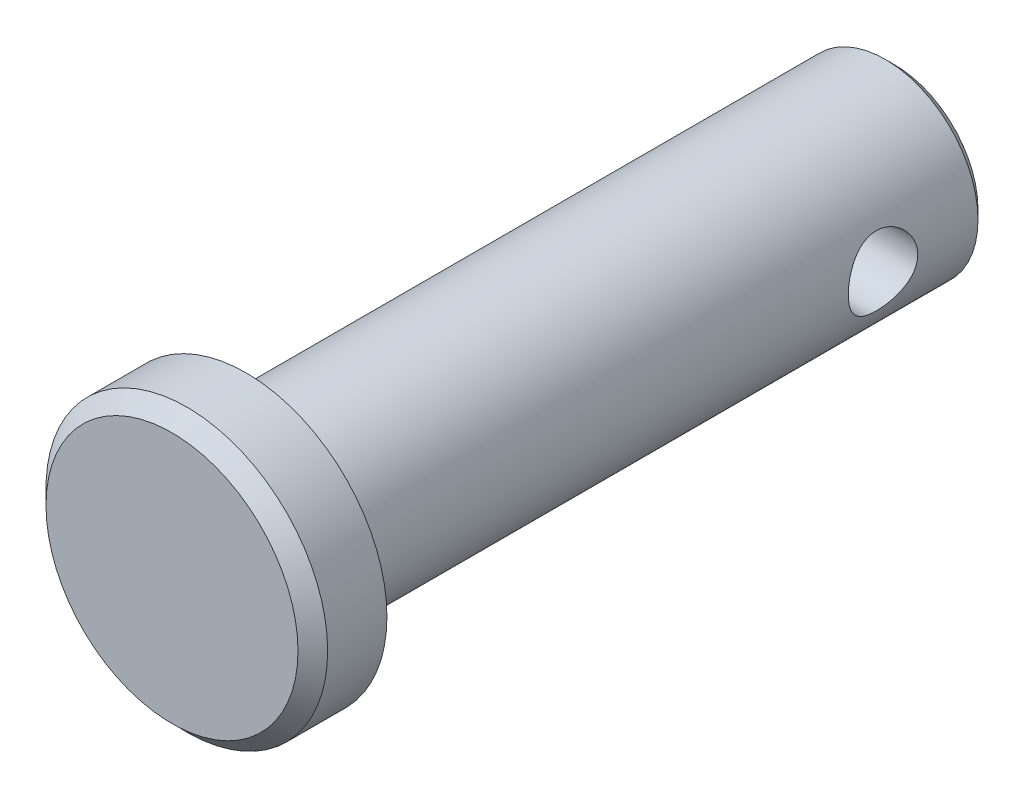
ISO-10303-21;
HEADER;
FILE_DESCRIPTION(('STEP AP214'),'2;1');
FILE_NAME('part.step','',(''),(''),'','','');
FILE_SCHEMA(('AUTOMOTIVE_DESIGN { 1 0 10303 214 1 1 1 1 }'));
ENDSEC;
DATA;
#1=APPLICATION_CONTEXT('core data for automotive mechanical design processes');
#2=APPLICATION_PROTOCOL_DEFINITION('international standard','automotive_design',2000,#1);
#3=PRODUCT_CONTEXT('',#1,'mechanical');
#4=PRODUCT('Part','Part','',(#3));
#5=PRODUCT_RELATED_PRODUCT_CATEGORY('part','',(#4));
#6=PRODUCT_DEFINITION_FORMATION('','',#4);
#7=PRODUCT_DEFINITION_CONTEXT('part definition',#1,'design');
#8=PRODUCT_DEFINITION('design','',#6,#7);
#9=PRODUCT_DEFINITION_SHAPE('','',#8);
#10=(LENGTH_UNIT() NAMED_UNIT(*) SI_UNIT(.MILLI.,.METRE.));
#11=(NAMED_UNIT(*) PLANE_ANGLE_UNIT() SI_UNIT($,.RADIAN.));
#12=(NAMED_UNIT(*) SI_UNIT($,.STERADIAN.) SOLID_ANGLE_UNIT());
#13=UNCERTAINTY_MEASURE_WITH_UNIT(LENGTH_MEASURE(1.E-05),#10,'distance_accuracy_value','');
#14=(GEOMETRIC_REPRESENTATION_CONTEXT(3) GLOBAL_UNCERTAINTY_ASSIGNED_CONTEXT((#13)) GLOBAL_UNIT_ASSIGNED_CONTEXT((#10,
#11,#12)) REPRESENTATION_CONTEXT('',''));
#15=CARTESIAN_POINT('',(0.,0.,0.));
#16=DIRECTION('',(0.,0.,1.));
#17=DIRECTION('',(1.,0.,0.));
#18=AXIS2_PLACEMENT_3D('',#15,#16,#17);
#19=CARTESIAN_POINT('',(-15.8559603431999,0.30035181385607,26.6681573409942));
#20=DIRECTION('',(0.,0.,-1.));
#21=DIRECTION('',(-1.,0.,0.));
#22=AXIS2_PLACEMENT_3D('',#19,#20,#21);
#23=CYLINDRICAL_SURFACE('',#22,3.175);
#24=CARTESIAN_POINT('',(-15.8559603431999,0.300351813856042,4.76065734099418));
#25=DIRECTION('',(0.,0.,1.));
#26=DIRECTION('',(1.,0.,0.));
#27=AXIS2_PLACEMENT_3D('',#24,#25,#26);
#28=CIRCLE('',#27,3.175);
#29=CARTESIAN_POINT('',(-12.6809603431999,0.300351813856042,4.76065734099418));
#30=VERTEX_POINT('',#29);
#31=EDGE_CURVE('E43',#30,#30,#28,.T.);
#32=ORIENTED_EDGE('',*,*,#31,.T.);
#33=EDGE_LOOP('',(#32));
#34=FACE_BOUND('',#33,.T.);
#35=CARTESIAN_POINT('',(-19.0309603431998,0.300351813855987,9.20565734099418));
#36=CARTESIAN_POINT('',(-19.030962069258,0.235871485824077,9.20565964469727));
#37=CARTESIAN_POINT('',(-19.0289789787602,0.17140693444171,9.20040290629703));
#38=CARTESIAN_POINT('',(-19.0212662427549,0.0444043860513533,9.17959996099868));
#39=CARTESIAN_POINT('',(-19.0155371369209,-0.0181338871091078,9.16405523624567));
#40=CARTESIAN_POINT('',(-19.0009473253077,-0.139433934230442,9.12330339583785));
#41=CARTESIAN_POINT('',(-18.9920926627236,-0.198202739072755,9.09811491826689));
#42=CARTESIAN_POINT('',(-18.9721336873374,-0.310676388583671,9.03888537566288));
#43=CARTESIAN_POINT('',(-18.9610287713186,-0.364379869741417,9.00484193621852));
#44=CARTESIAN_POINT('',(-18.9371886785339,-0.467479404674099,8.92735864445665));
#45=CARTESIAN_POINT('',(-18.924407363707,-0.516631828201475,8.88360894532577));
#46=CARTESIAN_POINT('',(-18.8988820963661,-0.607098281596737,8.78861280848372));
#47=CARTESIAN_POINT('',(-18.8861381564592,-0.648409912245172,8.73736408459944));
#48=CARTESIAN_POINT('',(-18.8615937037281,-0.723571416233376,8.62644410114764));
#49=CARTESIAN_POINT('',(-18.8498476182151,-0.757077119635308,8.56652637504843));
#50=CARTESIAN_POINT('',(-18.8293467338345,-0.813427441420762,8.4413964598729));
#51=CARTESIAN_POINT('',(-18.820590740571,-0.836276318023833,8.37618639773981));
#52=CARTESIAN_POINT('',(-18.8075547449915,-0.869702607345791,8.24512717841424));
#53=CARTESIAN_POINT('',(-18.8031058677347,-0.880744957316267,8.17941396673605));
#54=CARTESIAN_POINT('',(-18.7986937060482,-0.891698416113912,8.04692826558657));
#55=CARTESIAN_POINT('',(-18.7987285691205,-0.891614122014858,7.98015622498132));
#56=CARTESIAN_POINT('',(-18.8031343417792,-0.880672221173496,7.85170278035641));
#57=CARTESIAN_POINT('',(-18.8072456273644,-0.870459666184172,7.78995587182164));
#58=CARTESIAN_POINT('',(-18.8189095390475,-0.840617518598842,7.66912629035998));
#59=CARTESIAN_POINT('',(-18.8264626833846,-0.820986507846121,7.61004402011941));
#60=CARTESIAN_POINT('',(-18.844315604335,-0.772510440433503,7.4949061684849));
#61=CARTESIAN_POINT('',(-18.854664642231,-0.743498085494725,7.43892899888542));
#62=CARTESIAN_POINT('',(-18.8769268861807,-0.677199521635373,7.33245041178137));
#63=CARTESIAN_POINT('',(-18.8888406317034,-0.639910456054575,7.28195089383792));
#64=CARTESIAN_POINT('',(-18.913866651644,-0.555166070978449,7.18429068297129));
#65=CARTESIAN_POINT('',(-18.9270056636293,-0.507195932209815,7.13758248240039));
#66=CARTESIAN_POINT('',(-18.9523134355023,-0.403952555106571,7.05273908031835));
#67=CARTESIAN_POINT('',(-18.9644820460858,-0.348678196419987,7.01460519640093));
#68=CARTESIAN_POINT('',(-18.9867198519969,-0.231241164256682,6.9474938383258));
#69=CARTESIAN_POINT('',(-18.9967536731356,-0.16898519025821,6.91866707339997));
#70=CARTESIAN_POINT('',(-19.0133289199202,-0.0400374362478723,6.87204614885484));
#71=CARTESIAN_POINT('',(-19.0198718965355,0.0266523589971825,6.85424708909879));
#72=CARTESIAN_POINT('',(-19.0284556113227,0.158766464606748,6.83105675338276));
#73=CARTESIAN_POINT('',(-19.0307172098413,0.224069565828493,6.82505614717806));
#74=CARTESIAN_POINT('',(-19.0311658744446,0.354781216089662,6.82385880902362));
#75=CARTESIAN_POINT('',(-19.0293538438956,0.420189738536532,6.82865968174275));
#76=CARTESIAN_POINT('',(-19.0220045395202,0.546622314901957,6.84846593707668));
#77=CARTESIAN_POINT('',(-19.0166130814632,0.607718267961813,6.86307212883547));
#78=CARTESIAN_POINT('',(-19.0027939426154,0.726549331853281,6.9015487860786));
#79=CARTESIAN_POINT('',(-18.9943658669385,0.78428400444433,6.92542045649044));
#80=CARTESIAN_POINT('',(-18.9749979869359,0.896654727412172,6.98251155586802));
#81=CARTESIAN_POINT('',(-18.9639916573616,0.951149886430009,7.01598503856522));
#82=CARTESIAN_POINT('',(-18.9406845487444,1.05393227878902,7.09104233538658));
#83=CARTESIAN_POINT('',(-18.9283832925879,1.10221720932066,7.13262914370189));
#84=CARTESIAN_POINT('',(-18.9029548960346,1.19413876035948,7.22557186293033));
#85=CARTESIAN_POINT('',(-18.8898212466983,1.23734316221186,7.27735457356999));
#86=CARTESIAN_POINT('',(-18.8648984431906,1.31453452348426,7.38769312760586));
#87=CARTESIAN_POINT('',(-18.8531094098055,1.34852065520873,7.4462495785338));
#88=CARTESIAN_POINT('',(-18.8322595549157,1.40634539116304,7.56895753049471));
#89=CARTESIAN_POINT('',(-18.8232102533073,1.43014131709095,7.63313123306059));
#90=CARTESIAN_POINT('',(-18.8091392292723,1.46643313887448,7.76500884092138));
#91=CARTESIAN_POINT('',(-18.8041150153437,1.47893602565621,7.83271053472644));
#92=CARTESIAN_POINT('',(-18.798994008116,1.49166219394513,7.96503891762995));
#93=CARTESIAN_POINT('',(-18.7986014966039,1.49262250760426,8.02958386741947));
#94=CARTESIAN_POINT('',(-18.8020302443657,1.48412449426118,8.15786393578839));
#95=CARTESIAN_POINT('',(-18.805851104085,1.47466715516634,8.22159913057725));
#96=CARTESIAN_POINT('',(-18.8170299670343,1.44617610042103,8.34447607720045));
#97=CARTESIAN_POINT('',(-18.8242764583772,1.42744346299345,8.40369865332644));
#98=CARTESIAN_POINT('',(-18.8414251328141,1.38119878204665,8.51819483836165));
#99=CARTESIAN_POINT('',(-18.8513279871619,1.35368451910649,8.57346744464986));
#100=CARTESIAN_POINT('',(-18.8733194016876,1.28898391661508,8.68164485531667));
#101=CARTESIAN_POINT('',(-18.8854953245751,1.25136617422991,8.73427366095411));
#102=CARTESIAN_POINT('',(-18.910359926835,1.16819429433719,8.83270720501509));
#103=CARTESIAN_POINT('',(-18.9230487681861,1.12263763445772,8.87850976598118));
#104=CARTESIAN_POINT('',(-18.9483343385408,1.02193437880384,8.96451764342778));
#105=CARTESIAN_POINT('',(-18.9608889258488,0.966402237700102,9.00428594528297));
#106=CARTESIAN_POINT('',(-18.9837680517026,0.849002309771658,9.07391282361996));
#107=CARTESIAN_POINT('',(-18.9940924166466,0.787134030290414,9.10377062875993));
#108=CARTESIAN_POINT('',(-19.0117062907654,0.655951085195303,9.1535689490513));
#109=CARTESIAN_POINT('',(-19.0188449968944,0.586429967754379,9.17302394852195));
#110=CARTESIAN_POINT('',(-19.0284698905004,0.444715677406051,9.19906362793124));
#111=CARTESIAN_POINT('',(-19.0309584112437,0.372523863095593,9.20565476248725));
#112=CARTESIAN_POINT('',(-19.0309603431998,0.300351813855987,9.20565734099418));
#113=B_SPLINE_CURVE_WITH_KNOTS('',3,(#35,#36,#37,#38,#39,#40,#41,#42,#43,#44,#45,#46,#47,#48,
#49,#50,#51,#52,#53,#54,#55,#56,#57,#58,#59,#60,#61,#62,#63,#64,#65,#66,#67,#68,#69,#70,#71,#72,
#73,#74,#75,#76,#77,#78,#79,#80,#81,#82,#83,#84,#85,#86,#87,#88,#89,#90,#91,#92,#93,#94,#95,#96,
#97,#98,#99,#100,#101,#102,#103,#104,#105,#106,#107,#108,#109,#110,#111,#112),.UNSPECIFIED.,.T.,
.F.,(4,2,2,2,2,2,2,2,2,2,2,2,2,2,2,2,2,2,2,2,2,2,2,2,2,2,2,2,2,2,2,2,2,2,2,2,2,2,4),(0.,
0.193174779988653,0.386321736189723,0.579097274313209,0.771924557564978,0.972134347500262,
1.17240530159709,1.38030485385688,1.58812126298252,1.78741287818411,1.98662215450762,
2.17390936438972,2.36122478335587,2.5520841165719,2.7430094265325,2.94676634210297,
3.15055454712143,3.35749404133318,3.56434151635953,3.76019234336008,3.95599974284967,
4.1442833510204,4.33259145270714,4.5264325735105,4.72034536640764,4.92550862317922,
5.13069029517856,5.33672309214713,5.54262825746723,5.73531018512446,5.92797384230183,
6.11475744301057,6.30158828783598,6.49821274558135,6.6948997896016,6.9022303666289,
7.10957707657801,7.32590383806683,7.54212202675675),.UNSPECIFIED.);
#114=CARTESIAN_POINT('',(-19.0309603431998,0.300351813855987,9.20565734099418));
#115=VERTEX_POINT('',#114);
#116=EDGE_CURVE('E56',#115,#115,#113,.T.);
#117=ORIENTED_EDGE('',*,*,#116,.T.);
#118=EDGE_LOOP('',(#117));
#119=FACE_BOUND('',#118,.T.);
#120=CARTESIAN_POINT('',(-12.6809603431998,0.300351813856015,6.82440734099418));
#121=CARTESIAN_POINT('',(-12.6809586171416,0.235871485824099,6.82440503729109));
#122=CARTESIAN_POINT('',(-12.6829417076396,0.17140693444173,6.82966177569134));
#123=CARTESIAN_POINT('',(-12.6906544436449,0.0444043860513362,6.85046472098969));
#124=CARTESIAN_POINT('',(-12.6963835494787,-0.0181338871091588,6.86600944574269));
#125=CARTESIAN_POINT('',(-12.7109733610919,-0.139433934230485,6.90676128615051));
#126=CARTESIAN_POINT('',(-12.7198280236762,-0.198202739072758,6.93194976372147));
#127=CARTESIAN_POINT('',(-12.7397869990624,-0.310676388583652,6.99117930632548));
#128=CARTESIAN_POINT('',(-12.7508919150811,-0.364379869741418,7.02522274576985));
#129=CARTESIAN_POINT('',(-12.7747320078657,-0.467479404674104,7.10270603753171));
#130=CARTESIAN_POINT('',(-12.7875133226928,-0.516631828201464,7.14645573666258));
#131=CARTESIAN_POINT('',(-12.8130385900338,-0.60709828159672,7.24145187350464));
#132=CARTESIAN_POINT('',(-12.8257825299406,-0.648409912245165,7.29270059738893));
#133=CARTESIAN_POINT('',(-12.8503269826716,-0.723571416233382,7.40362058084072));
#134=CARTESIAN_POINT('',(-12.8620730681847,-0.757077119635316,7.46353830693992));
#135=CARTESIAN_POINT('',(-12.8825739525653,-0.813427441420741,7.58866822211545));
#136=CARTESIAN_POINT('',(-12.8913299458289,-0.836276318023781,7.65387828424855));
#137=CARTESIAN_POINT('',(-12.9043659414084,-0.869702607345732,7.78493750357413));
#138=CARTESIAN_POINT('',(-12.9088148186652,-0.88074495731623,7.85065071525232));
#139=CARTESIAN_POINT('',(-12.9132269803515,-0.891698416113949,7.98313641640179));
#140=CARTESIAN_POINT('',(-12.913192117279,-0.891614122014948,8.04990845700704));
#141=CARTESIAN_POINT('',(-12.9087863446203,-0.880672221173573,8.17836190163196));
#142=CARTESIAN_POINT('',(-12.9046750590354,-0.870459666184191,8.24010881016673));
#143=CARTESIAN_POINT('',(-12.8930111473525,-0.84061751859882,8.36093839162839));
#144=CARTESIAN_POINT('',(-12.8854580030152,-0.820986507846118,8.42002066186895));
#145=CARTESIAN_POINT('',(-12.8676050820648,-0.772510440433505,8.53515851350347));
#146=CARTESIAN_POINT('',(-12.8572560441689,-0.743498085494711,8.59113568310296));
#147=CARTESIAN_POINT('',(-12.8349938002191,-0.677199521635373,8.697614270207));
#148=CARTESIAN_POINT('',(-12.8230800546962,-0.639910456054605,8.74811378815045));
#149=CARTESIAN_POINT('',(-12.7980540347557,-0.555166070978481,8.84577399901707));
#150=CARTESIAN_POINT('',(-12.7849150227705,-0.507195932209816,8.89248219958797));
#151=CARTESIAN_POINT('',(-12.7596072508975,-0.403952555106578,8.97732560167002));
#152=CARTESIAN_POINT('',(-12.7474386403139,-0.348678196420031,9.01545948558744));
#153=CARTESIAN_POINT('',(-12.7252008344029,-0.231241164256732,9.08257084366257));
#154=CARTESIAN_POINT('',(-12.7151670132643,-0.168985190258227,9.1113976085884));
#155=CARTESIAN_POINT('',(-12.6985917664796,-0.0400374362478549,9.15801853313352));
#156=CARTESIAN_POINT('',(-12.6920487898642,0.0266523589972011,9.17581759288957));
#157=CARTESIAN_POINT('',(-12.683465075077,0.158766464606767,9.1990079286056));
#158=CARTESIAN_POINT('',(-12.6812034765585,0.22406956582851,9.20500853481031));
#159=CARTESIAN_POINT('',(-12.6807548119552,0.354781216089672,9.20620587296474));
#160=CARTESIAN_POINT('',(-12.6825668425042,0.420189738536538,9.20140500024562));
#161=CARTESIAN_POINT('',(-12.6899161468795,0.546622314901965,9.18159874491168));
#162=CARTESIAN_POINT('',(-12.6953076049366,0.607718267961827,9.16699255315288));
#163=CARTESIAN_POINT('',(-12.7091267437844,0.726549331853316,9.12851589590976));
#164=CARTESIAN_POINT('',(-12.7175548194613,0.784284004444381,9.10464422549793));
#165=CARTESIAN_POINT('',(-12.7369226994639,0.896654727412219,9.04755312612035));
#166=CARTESIAN_POINT('',(-12.7479290290382,0.951149886430039,9.01407964342313));
#167=CARTESIAN_POINT('',(-12.7712361376554,1.05393227878904,8.93902234660177));
#168=CARTESIAN_POINT('',(-12.7835373938119,1.10221720932069,8.89743553828647));
#169=CARTESIAN_POINT('',(-12.8089657903652,1.1941387603595,8.80449281905804));
#170=CARTESIAN_POINT('',(-12.8220994397016,1.23734316221186,8.75271010841835));
#171=CARTESIAN_POINT('',(-12.8470222432092,1.31453452348428,8.64237155438249));
#172=CARTESIAN_POINT('',(-12.8588112765943,1.34852065520879,8.58381510345457));
#173=CARTESIAN_POINT('',(-12.8796611314841,1.4063453911631,8.46110715149367));
#174=CARTESIAN_POINT('',(-12.8887104330925,1.43014131709096,8.39693344892779));
#175=CARTESIAN_POINT('',(-12.9027814571275,1.46643313887447,8.26505584106699));
#176=CARTESIAN_POINT('',(-12.9078056710559,1.47893602565621,8.19735414726193));
#177=CARTESIAN_POINT('',(-12.9129266782837,1.49166219394513,8.06502576435842));
#178=CARTESIAN_POINT('',(-12.9133191897959,1.49262250760425,8.0004808145689));
#179=CARTESIAN_POINT('',(-12.9098904420342,1.48412449426119,7.87220074619997));
#180=CARTESIAN_POINT('',(-12.9060695823149,1.4746671551664,7.80846555141111));
#181=CARTESIAN_POINT('',(-12.8948907193655,1.44617610042109,7.68558860478792));
#182=CARTESIAN_POINT('',(-12.8876442280226,1.42744346299346,7.62636602866194));
#183=CARTESIAN_POINT('',(-12.8704955535858,1.38119878204665,7.51186984362674));
#184=CARTESIAN_POINT('',(-12.8605926992379,1.35368451910651,7.45659723733851));
#185=CARTESIAN_POINT('',(-12.8386012847122,1.28898391661511,7.34841982667168));
#186=CARTESIAN_POINT('',(-12.8264253618248,1.25136617422993,7.29579102103423));
#187=CARTESIAN_POINT('',(-12.8015607595648,1.16819429433715,7.19735747697327));
#188=CARTESIAN_POINT('',(-12.7888719182137,1.12263763445765,7.15155491600721));
#189=CARTESIAN_POINT('',(-12.763586347859,1.02193437880377,7.0655470385606));
#190=CARTESIAN_POINT('',(-12.7510317605511,0.966402237700055,7.02577873670539));
#191=CARTESIAN_POINT('',(-12.7281526346972,0.84900230977167,6.95615185836839));
#192=CARTESIAN_POINT('',(-12.717828269753,0.787134030290453,6.92629405322843));
#193=CARTESIAN_POINT('',(-12.7002143956343,0.655951085195357,6.87649573293707));
#194=CARTESIAN_POINT('',(-12.6930756895055,0.586429967754418,6.85704073346642));
#195=CARTESIAN_POINT('',(-12.6834507958994,0.444715677406076,6.83100105405713));
#196=CARTESIAN_POINT('',(-12.6809622751558,0.372523863095618,6.82440991950112));
#197=CARTESIAN_POINT('',(-12.6809603431998,0.300351813856015,6.82440734099418));
#198=B_SPLINE_CURVE_WITH_KNOTS('',3,(#120,#121,#122,#123,#124,#125,#126,#127,#128,#129,#130,
#131,#132,#133,#134,#135,#136,#137,#138,#139,#140,#141,#142,#143,#144,#145,#146,#147,#148,#149,
#150,#151,#152,#153,#154,#155,#156,#157,#158,#159,#160,#161,#162,#163,#164,#165,#166,#167,#168,
#169,#170,#171,#172,#173,#174,#175,#176,#177,#178,#179,#180,#181,#182,#183,#184,#185,#186,#187,
#188,#189,#190,#191,#192,#193,#194,#195,#196,#197),.UNSPECIFIED.,.T.,.F.,(4,2,2,2,2,2,2,2,2,2,2,
2,2,2,2,2,2,2,2,2,2,2,2,2,2,2,2,2,2,2,2,2,2,2,2,2,2,2,4),(0.,0.193174779988689,
0.386321736189789,0.579097274313251,0.771924557565008,0.972134347500299,1.17240530159713,
1.38030485385691,1.58812126298256,1.78741287818415,1.98662215450767,2.17390936438976,
2.36122478335591,2.55208411657195,2.74300942653255,2.946766342103,3.15055454712144,
3.35749404133323,3.56434151635961,3.76019234336015,3.95599974284972,4.14428335102048,
4.33259145270725,4.52643257351059,4.72034536640772,4.92550862317931,5.13069029517863,
5.33672309214719,5.54262825746729,5.73531018512452,5.92797384230188,6.11475744301063,
6.30158828783604,6.49821274558144,6.69489978960173,6.90223036662899,7.10957707657804,
7.32590383806688,7.54212202675681),.UNSPECIFIED.);
#199=CARTESIAN_POINT('',(-12.6809603431998,0.300351813856015,6.82440734099418));
#200=VERTEX_POINT('',#199);
#201=EDGE_CURVE('E66',#200,#200,#198,.T.);
#202=ORIENTED_EDGE('',*,*,#201,.T.);
#203=EDGE_LOOP('',(#202));
#204=FACE_BOUND('',#203,.T.);
#205=CARTESIAN_POINT('',(-15.8559603431999,0.30035181385607,26.6681573409942));
#206=DIRECTION('',(0.,0.,1.));
#207=DIRECTION('',(1.,0.,0.));
#208=AXIS2_PLACEMENT_3D('',#205,#206,#207);
#209=CIRCLE('',#208,3.175);
#210=CARTESIAN_POINT('',(-12.6809603431999,0.30035181385607,26.6681573409942));
#211=VERTEX_POINT('',#210);
#212=EDGE_CURVE('E105',#211,#211,#209,.T.);
#213=ORIENTED_EDGE('',*,*,#212,.F.);
#214=EDGE_LOOP('',(#213));
#215=FACE_BOUND('',#214,.T.);
#216=ADVANCED_FACE('F35',(#34,#119,#204,#215),#23,.T.);
#217=CARTESIAN_POINT('',(-15.8559603431999,0.300351813856042,4.44315734099418));
#218=DIRECTION('',(0.,0.,1.));
#219=DIRECTION('',(1.,0.,0.));
#220=AXIS2_PLACEMENT_3D('',#217,#218,#219);
#221=PLANE('',#220);
#222=CARTESIAN_POINT('',(-15.8559603431999,0.300351813856042,4.44315734099418));
#223=DIRECTION('',(0.,0.,1.));
#224=DIRECTION('',(1.,0.,0.));
#225=AXIS2_PLACEMENT_3D('',#222,#223,#224);
#226=CIRCLE('',#225,2.8575);
#227=CARTESIAN_POINT('',(-12.9984603431999,0.300351813856042,4.44315734099418));
#228=VERTEX_POINT('',#227);
#229=EDGE_CURVE('E10',#228,#228,#226,.F.);
#230=ORIENTED_EDGE('',*,*,#229,.T.);
#231=EDGE_LOOP('',(#230));
#232=FACE_BOUND('',#231,.T.);
#233=ADVANCED_FACE('F87',(#232),#221,.F.);
#234=CARTESIAN_POINT('',(-15.8559603431999,0.30035181385607,26.6681573409942));
#235=DIRECTION('',(0.,0.,1.));
#236=DIRECTION('',(1.,0.,0.));
#237=AXIS2_PLACEMENT_3D('',#234,#235,#236);
#238=PLANE('',#237);
#239=CARTESIAN_POINT('',(-15.8559603431999,0.30035181385607,26.6681573409942));
#240=DIRECTION('',(0.,0.,1.));
#241=DIRECTION('',(1.,0.,0.));
#242=AXIS2_PLACEMENT_3D('',#239,#240,#241);
#243=CIRCLE('',#242,4.826);
#244=CARTESIAN_POINT('',(-11.0299603431999,0.30035181385607,26.6681573409942));
#245=VERTEX_POINT('',#244);
#246=EDGE_CURVE('E65',#245,#245,#243,.T.);
#247=ORIENTED_EDGE('',*,*,#246,.F.);
#248=EDGE_LOOP('',(#247));
#249=FACE_BOUND('',#248,.T.);
#250=ORIENTED_EDGE('',*,*,#212,.T.);
#251=EDGE_LOOP('',(#250));
#252=FACE_BOUND('',#251,.T.);
#253=ADVANCED_FACE('F84',(#249,#252),#238,.F.);
#254=CARTESIAN_POINT('',(-15.8559603431999,0.30035181385607,29.2081573409942));
#255=DIRECTION('',(0.,0.,-1.));
#256=DIRECTION('',(-1.,0.,0.));
#257=AXIS2_PLACEMENT_3D('',#254,#255,#256);
#258=CYLINDRICAL_SURFACE('',#257,4.826);
#259=CARTESIAN_POINT('',(-15.8559603431999,0.30035181385607,28.7001573409942));
#260=DIRECTION('',(0.,0.,1.));
#261=DIRECTION('',(1.,0.,0.));
#262=AXIS2_PLACEMENT_3D('',#259,#260,#261);
#263=CIRCLE('',#262,4.826);
#264=CARTESIAN_POINT('',(-11.0299603431999,0.30035181385607,28.7001573409942));
#265=VERTEX_POINT('',#264);
#266=EDGE_CURVE('E48',#265,#265,#263,.F.);
#267=ORIENTED_EDGE('',*,*,#266,.T.);
#268=EDGE_LOOP('',(#267));
#269=FACE_BOUND('',#268,.T.);
#270=ORIENTED_EDGE('',*,*,#246,.T.);
#271=EDGE_LOOP('',(#270));
#272=FACE_BOUND('',#271,.T.);
#273=ADVANCED_FACE('F82',(#269,#272),#258,.T.);
#274=CARTESIAN_POINT('',(-15.8559603431999,0.30035181385607,29.2081573409942));
#275=DIRECTION('',(0.,0.,1.));
#276=DIRECTION('',(1.,0.,0.));
#277=AXIS2_PLACEMENT_3D('',#274,#275,#276);
#278=PLANE('',#277);
#279=CARTESIAN_POINT('',(-15.8559603431999,0.30035181385607,29.2081573409942));
#280=DIRECTION('',(0.,0.,1.));
#281=DIRECTION('',(1.,0.,0.));
#282=AXIS2_PLACEMENT_3D('',#279,#280,#281);
#283=CIRCLE('',#282,4.318);
#284=CARTESIAN_POINT('',(-11.5379603431999,0.30035181385607,29.2081573409942));
#285=VERTEX_POINT('',#284);
#286=EDGE_CURVE('E53',#285,#285,#283,.T.);
#287=ORIENTED_EDGE('',*,*,#286,.T.);
#288=EDGE_LOOP('',(#287));
#289=FACE_BOUND('',#288,.T.);
#290=ADVANCED_FACE('F78',(#289),#278,.T.);
#291=CARTESIAN_POINT('',(-15.8559603431999,0.30035181385607,29.2081573409942));
#292=DIRECTION('',(0.,0.,-1.));
#293=DIRECTION('',(-1.,0.,0.));
#294=AXIS2_PLACEMENT_3D('',#291,#292,#293);
#295=CONICAL_SURFACE('',#294,4.318,0.785398163397449);
#296=ORIENTED_EDGE('',*,*,#266,.F.);
#297=EDGE_LOOP('',(#296));
#298=FACE_BOUND('',#297,.T.);
#299=ORIENTED_EDGE('',*,*,#286,.F.);
#300=EDGE_LOOP('',(#299));
#301=FACE_BOUND('',#300,.T.);
#302=ADVANCED_FACE('F76',(#298,#301),#295,.T.);
#303=CARTESIAN_POINT('',(-20.6819603431999,0.300351813856042,8.01503234099418));
#304=DIRECTION('',(1.,0.,0.));
#305=DIRECTION('',(0.,0.,-1.));
#306=AXIS2_PLACEMENT_3D('',#303,#304,#305);
#307=CYLINDRICAL_SURFACE('',#306,1.190625);
#308=ORIENTED_EDGE('',*,*,#201,.F.);
#309=EDGE_LOOP('',(#308));
#310=FACE_BOUND('',#309,.T.);
#311=ORIENTED_EDGE('',*,*,#116,.F.);
#312=EDGE_LOOP('',(#311));
#313=FACE_BOUND('',#312,.T.);
#314=ADVANCED_FACE('F72',(#310,#313),#307,.F.);
#315=CARTESIAN_POINT('',(-15.8559603431999,0.300351813856042,4.76065734099418));
#316=DIRECTION('',(0.,0.,1.));
#317=DIRECTION('',(1.,0.,0.));
#318=AXIS2_PLACEMENT_3D('',#315,#316,#317);
#319=CONICAL_SURFACE('',#318,3.175,0.785398163397452);
#320=ORIENTED_EDGE('',*,*,#229,.F.);
#321=EDGE_LOOP('',(#320));
#322=FACE_BOUND('',#321,.T.);
#323=ORIENTED_EDGE('',*,*,#31,.F.);
#324=EDGE_LOOP('',(#323));
#325=FACE_BOUND('',#324,.T.);
#326=ADVANCED_FACE('F37',(#322,#325),#319,.T.);
#327=CLOSED_SHELL('',(#216,#233,#253,#273,#290,#302,#314,#326));
#328=MANIFOLD_SOLID_BREP('B2',#327);
#329=ADVANCED_BREP_SHAPE_REPRESENTATION('',(#18,#328),#14);
#330=SHAPE_DEFINITION_REPRESENTATION(#9,#329);
ENDSEC;
END-ISO-10303-21;
